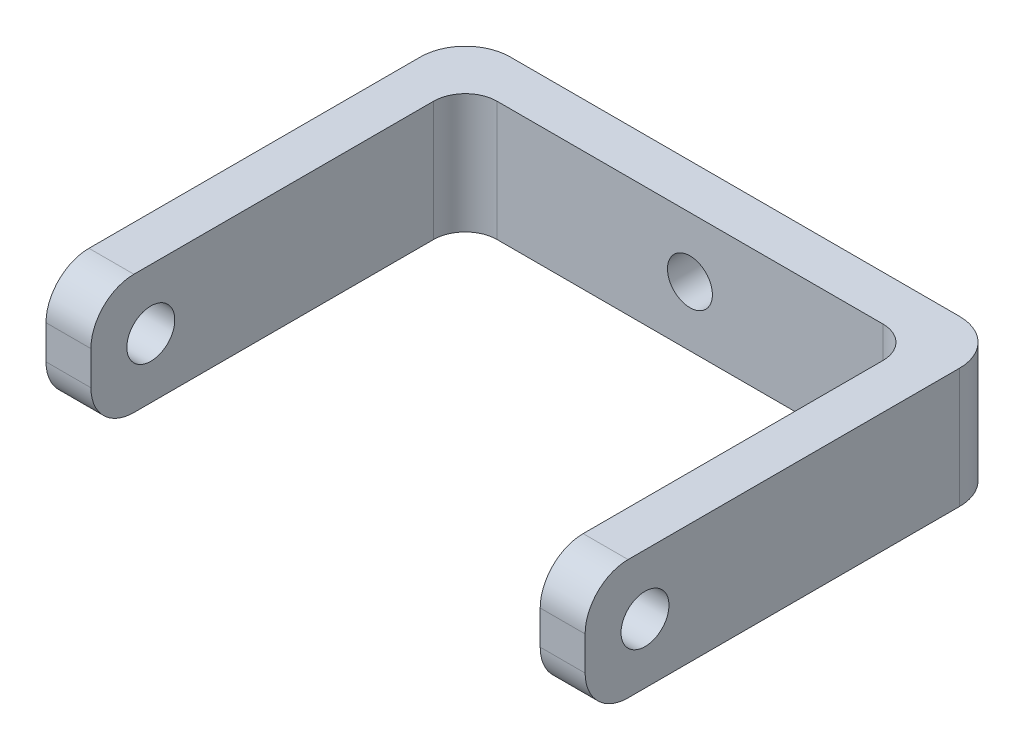
ISO-10303-21;
HEADER;
FILE_DESCRIPTION(('STEP AP214'),'2;1');
FILE_NAME('part.step','',(''),(''),'','','');
FILE_SCHEMA(('AUTOMOTIVE_DESIGN { 1 0 10303 214 1 1 1 1 }'));
ENDSEC;
DATA;
#1=APPLICATION_CONTEXT('core data for automotive mechanical design processes');
#2=APPLICATION_PROTOCOL_DEFINITION('international standard','automotive_design',2000,#1);
#3=PRODUCT_CONTEXT('',#1,'mechanical');
#4=PRODUCT('Part','Part','',(#3));
#5=PRODUCT_RELATED_PRODUCT_CATEGORY('part','',(#4));
#6=PRODUCT_DEFINITION_FORMATION('','',#4);
#7=PRODUCT_DEFINITION_CONTEXT('part definition',#1,'design');
#8=PRODUCT_DEFINITION('design','',#6,#7);
#9=PRODUCT_DEFINITION_SHAPE('','',#8);
#10=(LENGTH_UNIT() NAMED_UNIT(*) SI_UNIT(.MILLI.,.METRE.));
#11=(NAMED_UNIT(*) PLANE_ANGLE_UNIT() SI_UNIT($,.RADIAN.));
#12=(NAMED_UNIT(*) SI_UNIT($,.STERADIAN.) SOLID_ANGLE_UNIT());
#13=UNCERTAINTY_MEASURE_WITH_UNIT(LENGTH_MEASURE(1.E-05),#10,'distance_accuracy_value','');
#14=(GEOMETRIC_REPRESENTATION_CONTEXT(3) GLOBAL_UNCERTAINTY_ASSIGNED_CONTEXT((#13)) GLOBAL_UNIT_ASSIGNED_CONTEXT((#10,
#11,#12)) REPRESENTATION_CONTEXT('',''));
#15=CARTESIAN_POINT('',(0.,0.,0.));
#16=DIRECTION('',(0.,0.,1.));
#17=DIRECTION('',(1.,0.,0.));
#18=AXIS2_PLACEMENT_3D('',#15,#16,#17);
#19=CARTESIAN_POINT('',(30.,8.,0.));
#20=DIRECTION('',(-1.,0.,0.));
#21=DIRECTION('',(0.,0.,1.));
#22=AXIS2_PLACEMENT_3D('',#19,#20,#21);
#23=PLANE('',#22);
#24=CARTESIAN_POINT('',(30.,4.,-4.00000000000004));
#25=DIRECTION('',(-1.,0.,0.));
#26=DIRECTION('',(0.,0.,1.));
#27=AXIS2_PLACEMENT_3D('',#24,#25,#26);
#28=CIRCLE('',#27,1.6);
#29=CARTESIAN_POINT('',(30.,4.,-2.40000000000004));
#30=VERTEX_POINT('',#29);
#31=EDGE_CURVE('E180',#30,#30,#28,.T.);
#32=ORIENTED_EDGE('',*,*,#31,.F.);
#33=EDGE_LOOP('',(#32));
#34=FACE_BOUND('',#33,.T.);
#35=DIRECTION('',(0.,0.,-1.));
#36=VECTOR('',#35,1.);
#37=CARTESIAN_POINT('',(30.,0.,0.));
#38=LINE('',#37,#36);
#39=CARTESIAN_POINT('',(30.,0.,-2.86862915010155));
#40=VERTEX_POINT('',#39);
#41=CARTESIAN_POINT('',(30.,0.,-22.8786796564404));
#42=VERTEX_POINT('',#41);
#43=EDGE_CURVE('E186',#40,#42,#38,.T.);
#44=ORIENTED_EDGE('',*,*,#43,.F.);
#45=CARTESIAN_POINT('',(30.,2.86862915010154,-2.86862915010155));
#46=DIRECTION('',(-1.,0.,0.));
#47=DIRECTION('',(0.,0.,1.));
#48=AXIS2_PLACEMENT_3D('',#45,#46,#47);
#49=CIRCLE('',#48,2.86862915010155);
#50=CARTESIAN_POINT('',(30.,2.86862915010154,0.));
#51=VERTEX_POINT('',#50);
#52=EDGE_CURVE('E245',#40,#51,#49,.T.);
#53=ORIENTED_EDGE('',*,*,#52,.T.);
#54=DIRECTION('',(0.,-1.,0.));
#55=VECTOR('',#54,1.);
#56=CARTESIAN_POINT('',(30.,8.,0.));
#57=LINE('',#56,#55);
#58=CARTESIAN_POINT('',(30.,5.13137084989846,0.));
#59=VERTEX_POINT('',#58);
#60=EDGE_CURVE('E213',#59,#51,#57,.T.);
#61=ORIENTED_EDGE('',*,*,#60,.F.);
#62=CARTESIAN_POINT('',(30.,5.13137084989846,-2.86862915010155));
#63=DIRECTION('',(-1.,0.,0.));
#64=DIRECTION('',(0.,0.,1.));
#65=AXIS2_PLACEMENT_3D('',#62,#63,#64);
#66=CIRCLE('',#65,2.86862915010155);
#67=CARTESIAN_POINT('',(30.,8.,-2.86862915010155));
#68=VERTEX_POINT('',#67);
#69=EDGE_CURVE('E230',#59,#68,#66,.T.);
#70=ORIENTED_EDGE('',*,*,#69,.T.);
#71=DIRECTION('',(0.,0.,-1.));
#72=VECTOR('',#71,1.);
#73=CARTESIAN_POINT('',(30.,8.,0.));
#74=LINE('',#73,#72);
#75=CARTESIAN_POINT('',(30.,8.,-22.8786796564404));
#76=VERTEX_POINT('',#75);
#77=EDGE_CURVE('E274',#68,#76,#74,.T.);
#78=ORIENTED_EDGE('',*,*,#77,.T.);
#79=DIRECTION('',(0.,-1.,0.));
#80=VECTOR('',#79,1.);
#81=CARTESIAN_POINT('',(30.,8.,-22.8786796564404));
#82=LINE('',#81,#80);
#83=EDGE_CURVE('E216',#76,#42,#82,.T.);
#84=ORIENTED_EDGE('',*,*,#83,.T.);
#85=EDGE_LOOP('',(#44,#53,#61,#70,#78,#84));
#86=FACE_BOUND('',#85,.T.);
#87=ADVANCED_FACE('F35',(#34,#86),#23,.T.);
#88=CARTESIAN_POINT('',(0.,8.,0.));
#89=DIRECTION('',(0.,0.,1.));
#90=DIRECTION('',(1.,0.,0.));
#91=AXIS2_PLACEMENT_3D('',#88,#89,#90);
#92=PLANE('',#91);
#93=DIRECTION('',(-1.,0.,0.));
#94=VECTOR('',#93,1.);
#95=CARTESIAN_POINT('',(33.,2.86862915010154,0.));
#96=LINE('',#95,#94);
#97=CARTESIAN_POINT('',(33.,2.86862915010154,0.));
#98=VERTEX_POINT('',#97);
#99=EDGE_CURVE('E253',#98,#51,#96,.T.);
#100=ORIENTED_EDGE('',*,*,#99,.F.);
#101=DIRECTION('',(0.,-1.,0.));
#102=VECTOR('',#101,1.);
#103=CARTESIAN_POINT('',(33.,8.,0.));
#104=LINE('',#103,#102);
#105=CARTESIAN_POINT('',(33.,5.13137084989846,0.));
#106=VERTEX_POINT('',#105);
#107=EDGE_CURVE('E210',#106,#98,#104,.T.);
#108=ORIENTED_EDGE('',*,*,#107,.F.);
#109=DIRECTION('',(-1.,0.,0.));
#110=VECTOR('',#109,1.);
#111=CARTESIAN_POINT('',(33.,5.13137084989846,0.));
#112=LINE('',#111,#110);
#113=EDGE_CURVE('E256',#106,#59,#112,.T.);
#114=ORIENTED_EDGE('',*,*,#113,.T.);
#115=ORIENTED_EDGE('',*,*,#60,.T.);
#116=EDGE_LOOP('',(#100,#108,#114,#115));
#117=FACE_BOUND('',#116,.T.);
#118=ADVANCED_FACE('F303',(#117),#92,.T.);
#119=CARTESIAN_POINT('',(33.,8.,0.));
#120=DIRECTION('',(1.,0.,0.));
#121=DIRECTION('',(0.,0.,-1.));
#122=AXIS2_PLACEMENT_3D('',#119,#120,#121);
#123=PLANE('',#122);
#124=CARTESIAN_POINT('',(33.,4.,-4.00000000000004));
#125=DIRECTION('',(-1.,0.,0.));
#126=DIRECTION('',(0.,0.,1.));
#127=AXIS2_PLACEMENT_3D('',#124,#125,#126);
#128=CIRCLE('',#127,1.6);
#129=CARTESIAN_POINT('',(33.,4.,-2.40000000000004));
#130=VERTEX_POINT('',#129);
#131=EDGE_CURVE('E226',#130,#130,#128,.T.);
#132=ORIENTED_EDGE('',*,*,#131,.T.);
#133=EDGE_LOOP('',(#132));
#134=FACE_BOUND('',#133,.T.);
#135=ORIENTED_EDGE('',*,*,#107,.T.);
#136=CARTESIAN_POINT('',(33.,2.86862915010154,-2.86862915010155));
#137=DIRECTION('',(-1.,0.,0.));
#138=DIRECTION('',(0.,0.,1.));
#139=AXIS2_PLACEMENT_3D('',#136,#137,#138);
#140=CIRCLE('',#139,2.86862915010155);
#141=CARTESIAN_POINT('',(33.,0.,-2.86862915010155));
#142=VERTEX_POINT('',#141);
#143=EDGE_CURVE('E289',#142,#98,#140,.T.);
#144=ORIENTED_EDGE('',*,*,#143,.F.);
#145=DIRECTION('',(0.,0.,1.));
#146=VECTOR('',#145,1.);
#147=CARTESIAN_POINT('',(33.,0.,0.));
#148=LINE('',#147,#146);
#149=CARTESIAN_POINT('',(33.,0.,-25.));
#150=VERTEX_POINT('',#149);
#151=EDGE_CURVE('E188',#150,#142,#148,.T.);
#152=ORIENTED_EDGE('',*,*,#151,.F.);
#153=DIRECTION('',(0.,-1.,0.));
#154=VECTOR('',#153,1.);
#155=CARTESIAN_POINT('',(33.,8.,-25.));
#156=LINE('',#155,#154);
#157=CARTESIAN_POINT('',(33.,8.,-25.));
#158=VERTEX_POINT('',#157);
#159=EDGE_CURVE('E208',#158,#150,#156,.T.);
#160=ORIENTED_EDGE('',*,*,#159,.F.);
#161=DIRECTION('',(0.,0.,1.));
#162=VECTOR('',#161,1.);
#163=CARTESIAN_POINT('',(33.,8.,0.));
#164=LINE('',#163,#162);
#165=CARTESIAN_POINT('',(33.,8.,-2.86862915010155));
#166=VERTEX_POINT('',#165);
#167=EDGE_CURVE('E169',#158,#166,#164,.T.);
#168=ORIENTED_EDGE('',*,*,#167,.T.);
#169=CARTESIAN_POINT('',(33.,5.13137084989846,-2.86862915010155));
#170=DIRECTION('',(-1.,0.,0.));
#171=DIRECTION('',(0.,0.,1.));
#172=AXIS2_PLACEMENT_3D('',#169,#170,#171);
#173=CIRCLE('',#172,2.86862915010155);
#174=EDGE_CURVE('E279',#106,#166,#173,.T.);
#175=ORIENTED_EDGE('',*,*,#174,.F.);
#176=EDGE_LOOP('',(#135,#144,#152,#160,#168,#175));
#177=FACE_BOUND('',#176,.T.);
#178=ADVANCED_FACE('F278',(#134,#177),#123,.T.);
#179=CARTESIAN_POINT('',(-3.,8.,0.));
#180=DIRECTION('',(-1.,0.,0.));
#181=DIRECTION('',(0.,0.,1.));
#182=AXIS2_PLACEMENT_3D('',#179,#180,#181);
#183=PLANE('',#182);
#184=CARTESIAN_POINT('',(-3.,4.,-4.00000000000004));
#185=DIRECTION('',(-1.,0.,0.));
#186=DIRECTION('',(0.,0.,1.));
#187=AXIS2_PLACEMENT_3D('',#184,#185,#186);
#188=CIRCLE('',#187,1.6);
#189=CARTESIAN_POINT('',(-3.,4.,-2.40000000000004));
#190=VERTEX_POINT('',#189);
#191=EDGE_CURVE('E225',#190,#190,#188,.T.);
#192=ORIENTED_EDGE('',*,*,#191,.F.);
#193=EDGE_LOOP('',(#192));
#194=FACE_BOUND('',#193,.T.);
#195=DIRECTION('',(0.,0.,-1.));
#196=VECTOR('',#195,1.);
#197=CARTESIAN_POINT('',(-3.,0.,0.));
#198=LINE('',#197,#196);
#199=CARTESIAN_POINT('',(-3.,0.,-2.86862915010155));
#200=VERTEX_POINT('',#199);
#201=CARTESIAN_POINT('',(-3.,0.,-25.));
#202=VERTEX_POINT('',#201);
#203=EDGE_CURVE('E197',#200,#202,#198,.T.);
#204=ORIENTED_EDGE('',*,*,#203,.F.);
#205=CARTESIAN_POINT('',(-3.,2.86862915010154,-2.86862915010155));
#206=DIRECTION('',(-1.,0.,0.));
#207=DIRECTION('',(0.,0.,1.));
#208=AXIS2_PLACEMENT_3D('',#205,#206,#207);
#209=CIRCLE('',#208,2.86862915010155);
#210=CARTESIAN_POINT('',(-3.,2.86862915010154,0.));
#211=VERTEX_POINT('',#210);
#212=EDGE_CURVE('E39',#200,#211,#209,.T.);
#213=ORIENTED_EDGE('',*,*,#212,.T.);
#214=DIRECTION('',(0.,1.,0.));
#215=VECTOR('',#214,1.);
#216=CARTESIAN_POINT('',(-3.,8.,0.));
#217=LINE('',#216,#215);
#218=CARTESIAN_POINT('',(-3.,5.13137084989846,0.));
#219=VERTEX_POINT('',#218);
#220=EDGE_CURVE('E205',#219,#211,#217,.F.);
#221=ORIENTED_EDGE('',*,*,#220,.F.);
#222=CARTESIAN_POINT('',(-3.,5.13137084989846,-2.86862915010155));
#223=DIRECTION('',(-1.,0.,0.));
#224=DIRECTION('',(0.,0.,1.));
#225=AXIS2_PLACEMENT_3D('',#222,#223,#224);
#226=CIRCLE('',#225,2.86862915010155);
#227=CARTESIAN_POINT('',(-3.,8.,-2.86862915010155));
#228=VERTEX_POINT('',#227);
#229=EDGE_CURVE('E228',#219,#228,#226,.T.);
#230=ORIENTED_EDGE('',*,*,#229,.T.);
#231=DIRECTION('',(0.,0.,-1.));
#232=VECTOR('',#231,1.);
#233=CARTESIAN_POINT('',(-3.,8.,0.));
#234=LINE('',#233,#232);
#235=CARTESIAN_POINT('',(-3.,8.,-25.));
#236=VERTEX_POINT('',#235);
#237=EDGE_CURVE('E160',#228,#236,#234,.T.);
#238=ORIENTED_EDGE('',*,*,#237,.T.);
#239=DIRECTION('',(0.,-1.,0.));
#240=VECTOR('',#239,1.);
#241=CARTESIAN_POINT('',(-3.,8.,-25.));
#242=LINE('',#241,#240);
#243=EDGE_CURVE('E152',#236,#202,#242,.T.);
#244=ORIENTED_EDGE('',*,*,#243,.T.);
#245=EDGE_LOOP('',(#204,#213,#221,#230,#238,#244));
#246=FACE_BOUND('',#245,.T.);
#247=ADVANCED_FACE('F244',(#194,#246),#183,.T.);
#248=CARTESIAN_POINT('',(0.,8.,0.));
#249=DIRECTION('',(0.,0.,1.));
#250=DIRECTION('',(1.,0.,0.));
#251=AXIS2_PLACEMENT_3D('',#248,#249,#250);
#252=PLANE('',#251);
#253=CARTESIAN_POINT('',(0.,2.86862915010154,0.));
#254=VERTEX_POINT('',#253);
#255=EDGE_CURVE('E239',#254,#211,#96,.T.);
#256=ORIENTED_EDGE('',*,*,#255,.F.);
#257=DIRECTION('',(0.,-1.,0.));
#258=VECTOR('',#257,1.);
#259=CARTESIAN_POINT('',(0.,8.,0.));
#260=LINE('',#259,#258);
#261=CARTESIAN_POINT('',(0.,5.13137084989846,0.));
#262=VERTEX_POINT('',#261);
#263=EDGE_CURVE('E202',#262,#254,#260,.T.);
#264=ORIENTED_EDGE('',*,*,#263,.F.);
#265=EDGE_CURVE('E240',#262,#219,#112,.T.);
#266=ORIENTED_EDGE('',*,*,#265,.T.);
#267=ORIENTED_EDGE('',*,*,#220,.T.);
#268=EDGE_LOOP('',(#256,#264,#266,#267));
#269=FACE_BOUND('',#268,.T.);
#270=ADVANCED_FACE('F236',(#269),#252,.T.);
#271=CARTESIAN_POINT('',(0.,8.,0.));
#272=DIRECTION('',(-1.,0.,0.));
#273=DIRECTION('',(0.,0.,1.));
#274=AXIS2_PLACEMENT_3D('',#271,#272,#273);
#275=PLANE('',#274);
#276=CARTESIAN_POINT('',(0.,4.,-4.00000000000004));
#277=DIRECTION('',(-1.,0.,0.));
#278=DIRECTION('',(0.,0.,1.));
#279=AXIS2_PLACEMENT_3D('',#276,#277,#278);
#280=CIRCLE('',#279,1.6);
#281=CARTESIAN_POINT('',(0.,4.,-2.40000000000004));
#282=VERTEX_POINT('',#281);
#283=EDGE_CURVE('E222',#282,#282,#280,.T.);
#284=ORIENTED_EDGE('',*,*,#283,.T.);
#285=EDGE_LOOP('',(#284));
#286=FACE_BOUND('',#285,.T.);
#287=CARTESIAN_POINT('',(0.,2.86862915010154,-2.86862915010155));
#288=DIRECTION('',(-1.,0.,0.));
#289=DIRECTION('',(0.,0.,1.));
#290=AXIS2_PLACEMENT_3D('',#287,#288,#289);
#291=CIRCLE('',#290,2.86862915010155);
#292=CARTESIAN_POINT('',(0.,0.,-2.86862915010155));
#293=VERTEX_POINT('',#292);
#294=EDGE_CURVE('E246',#293,#254,#291,.T.);
#295=ORIENTED_EDGE('',*,*,#294,.F.);
#296=DIRECTION('',(0.,0.,-1.));
#297=VECTOR('',#296,1.);
#298=CARTESIAN_POINT('',(0.,0.,0.));
#299=LINE('',#298,#297);
#300=CARTESIAN_POINT('',(0.,0.,-22.8786796564404));
#301=VERTEX_POINT('',#300);
#302=EDGE_CURVE('E114',#293,#301,#299,.T.);
#303=ORIENTED_EDGE('',*,*,#302,.T.);
#304=DIRECTION('',(0.,-1.,0.));
#305=VECTOR('',#304,1.);
#306=CARTESIAN_POINT('',(0.,8.,-22.8786796564404));
#307=LINE('',#306,#305);
#308=CARTESIAN_POINT('',(0.,8.,-22.8786796564404));
#309=VERTEX_POINT('',#308);
#310=EDGE_CURVE('E175',#309,#301,#307,.T.);
#311=ORIENTED_EDGE('',*,*,#310,.F.);
#312=DIRECTION('',(0.,0.,-1.));
#313=VECTOR('',#312,1.);
#314=CARTESIAN_POINT('',(0.,8.,0.));
#315=LINE('',#314,#313);
#316=CARTESIAN_POINT('',(0.,8.,-2.86862915010155));
#317=VERTEX_POINT('',#316);
#318=EDGE_CURVE('E79',#317,#309,#315,.T.);
#319=ORIENTED_EDGE('',*,*,#318,.F.);
#320=CARTESIAN_POINT('',(0.,5.13137084989846,-2.86862915010155));
#321=DIRECTION('',(-1.,0.,0.));
#322=DIRECTION('',(0.,0.,1.));
#323=AXIS2_PLACEMENT_3D('',#320,#321,#322);
#324=CIRCLE('',#323,2.86862915010155);
#325=EDGE_CURVE('E53',#262,#317,#324,.T.);
#326=ORIENTED_EDGE('',*,*,#325,.F.);
#327=ORIENTED_EDGE('',*,*,#263,.T.);
#328=EDGE_LOOP('',(#295,#303,#311,#319,#326,#327));
#329=FACE_BOUND('',#328,.T.);
#330=ADVANCED_FACE('F323',(#286,#329),#275,.F.);
#331=CARTESIAN_POINT('',(2.12132034355964,8.,-22.8786796564404));
#332=DIRECTION('',(0.,-1.,0.));
#333=DIRECTION('',(0.,0.,-1.));
#334=AXIS2_PLACEMENT_3D('',#331,#332,#333);
#335=CYLINDRICAL_SURFACE('',#334,2.12132034355964);
#336=CARTESIAN_POINT('',(2.12132034355964,0.,-22.8786796564404));
#337=DIRECTION('',(0.,1.,0.));
#338=DIRECTION('',(0.,0.,1.));
#339=AXIS2_PLACEMENT_3D('',#336,#337,#338);
#340=CIRCLE('',#339,2.12132034355964);
#341=CARTESIAN_POINT('',(2.12132034355964,0.,-25.));
#342=VERTEX_POINT('',#341);
#343=EDGE_CURVE('E176',#342,#301,#340,.T.);
#344=ORIENTED_EDGE('',*,*,#343,.F.);
#345=DIRECTION('',(0.,-1.,0.));
#346=VECTOR('',#345,1.);
#347=CARTESIAN_POINT('',(2.12132034355964,8.,-25.));
#348=LINE('',#347,#346);
#349=CARTESIAN_POINT('',(2.12132034355964,8.,-25.));
#350=VERTEX_POINT('',#349);
#351=EDGE_CURVE('E122',#350,#342,#348,.T.);
#352=ORIENTED_EDGE('',*,*,#351,.F.);
#353=CARTESIAN_POINT('',(2.12132034355964,8.,-22.8786796564404));
#354=DIRECTION('',(0.,1.,0.));
#355=DIRECTION('',(0.,0.,1.));
#356=AXIS2_PLACEMENT_3D('',#353,#354,#355);
#357=CIRCLE('',#356,2.12132034355964);
#358=EDGE_CURVE('E200',#350,#309,#357,.T.);
#359=ORIENTED_EDGE('',*,*,#358,.T.);
#360=ORIENTED_EDGE('',*,*,#310,.T.);
#361=EDGE_LOOP('',(#344,#352,#359,#360));
#362=FACE_BOUND('',#361,.T.);
#363=ADVANCED_FACE('F37',(#362),#335,.F.);
#364=CARTESIAN_POINT('',(0.,8.,-25.));
#365=DIRECTION('',(0.,0.,-1.));
#366=DIRECTION('',(-1.,0.,0.));
#367=AXIS2_PLACEMENT_3D('',#364,#365,#366);
#368=PLANE('',#367);
#369=CARTESIAN_POINT('',(15.,4.,-25.));
#370=DIRECTION('',(0.,0.,-1.));
#371=DIRECTION('',(-1.,0.,0.));
#372=AXIS2_PLACEMENT_3D('',#369,#370,#371);
#373=CIRCLE('',#372,1.5);
#374=CARTESIAN_POINT('',(13.5,4.,-25.));
#375=VERTEX_POINT('',#374);
#376=EDGE_CURVE('E359',#375,#375,#373,.T.);
#377=ORIENTED_EDGE('',*,*,#376,.T.);
#378=EDGE_LOOP('',(#377));
#379=FACE_BOUND('',#378,.T.);
#380=DIRECTION('',(1.,0.,0.));
#381=VECTOR('',#380,1.);
#382=CARTESIAN_POINT('',(0.,0.,-25.));
#383=LINE('',#382,#381);
#384=CARTESIAN_POINT('',(27.8786796564404,0.,-25.));
#385=VERTEX_POINT('',#384);
#386=EDGE_CURVE('E179',#342,#385,#383,.T.);
#387=ORIENTED_EDGE('',*,*,#386,.T.);
#388=DIRECTION('',(0.,-1.,0.));
#389=VECTOR('',#388,1.);
#390=CARTESIAN_POINT('',(27.8786796564404,8.,-25.));
#391=LINE('',#390,#389);
#392=CARTESIAN_POINT('',(27.8786796564404,8.,-25.));
#393=VERTEX_POINT('',#392);
#394=EDGE_CURVE('E219',#393,#385,#391,.T.);
#395=ORIENTED_EDGE('',*,*,#394,.F.);
#396=DIRECTION('',(1.,0.,0.));
#397=VECTOR('',#396,1.);
#398=CARTESIAN_POINT('',(0.,8.,-25.));
#399=LINE('',#398,#397);
#400=EDGE_CURVE('E269',#350,#393,#399,.T.);
#401=ORIENTED_EDGE('',*,*,#400,.F.);
#402=ORIENTED_EDGE('',*,*,#351,.T.);
#403=EDGE_LOOP('',(#387,#395,#401,#402));
#404=FACE_BOUND('',#403,.T.);
#405=ADVANCED_FACE('F349',(#379,#404),#368,.F.);
#406=CARTESIAN_POINT('',(27.8786796564404,8.,-22.8786796564404));
#407=DIRECTION('',(0.,-1.,0.));
#408=DIRECTION('',(0.,0.,-1.));
#409=AXIS2_PLACEMENT_3D('',#406,#407,#408);
#410=CYLINDRICAL_SURFACE('',#409,2.12132034355964);
#411=CARTESIAN_POINT('',(27.8786796564404,0.,-22.8786796564404));
#412=DIRECTION('',(0.,1.,0.));
#413=DIRECTION('',(0.,0.,1.));
#414=AXIS2_PLACEMENT_3D('',#411,#412,#413);
#415=CIRCLE('',#414,2.12132034355964);
#416=EDGE_CURVE('E183',#42,#385,#415,.T.);
#417=ORIENTED_EDGE('',*,*,#416,.F.);
#418=ORIENTED_EDGE('',*,*,#83,.F.);
#419=CARTESIAN_POINT('',(27.8786796564404,8.,-22.8786796564404));
#420=DIRECTION('',(0.,1.,0.));
#421=DIRECTION('',(0.,0.,1.));
#422=AXIS2_PLACEMENT_3D('',#419,#420,#421);
#423=CIRCLE('',#422,2.12132034355964);
#424=EDGE_CURVE('E271',#76,#393,#423,.T.);
#425=ORIENTED_EDGE('',*,*,#424,.T.);
#426=ORIENTED_EDGE('',*,*,#394,.T.);
#427=EDGE_LOOP('',(#417,#418,#425,#426));
#428=FACE_BOUND('',#427,.T.);
#429=ADVANCED_FACE('F346',(#428),#410,.F.);
#430=CARTESIAN_POINT('',(30.,8.,-25.));
#431=DIRECTION('',(0.,-1.,0.));
#432=DIRECTION('',(0.,0.,-1.));
#433=AXIS2_PLACEMENT_3D('',#430,#431,#432);
#434=CYLINDRICAL_SURFACE('',#433,3.);
#435=CARTESIAN_POINT('',(30.,0.,-25.));
#436=DIRECTION('',(0.,1.,0.));
#437=DIRECTION('',(0.,0.,1.));
#438=AXIS2_PLACEMENT_3D('',#435,#436,#437);
#439=CIRCLE('',#438,3.);
#440=CARTESIAN_POINT('',(30.,0.,-28.));
#441=VERTEX_POINT('',#440);
#442=EDGE_CURVE('E191',#150,#441,#439,.T.);
#443=ORIENTED_EDGE('',*,*,#442,.T.);
#444=DIRECTION('',(0.,-1.,0.));
#445=VECTOR('',#444,1.);
#446=CARTESIAN_POINT('',(30.,8.,-28.));
#447=LINE('',#446,#445);
#448=CARTESIAN_POINT('',(30.,8.,-28.));
#449=VERTEX_POINT('',#448);
#450=EDGE_CURVE('E151',#449,#441,#447,.T.);
#451=ORIENTED_EDGE('',*,*,#450,.F.);
#452=CARTESIAN_POINT('',(30.,8.,-25.));
#453=DIRECTION('',(0.,1.,0.));
#454=DIRECTION('',(0.,0.,1.));
#455=AXIS2_PLACEMENT_3D('',#452,#453,#454);
#456=CIRCLE('',#455,3.);
#457=EDGE_CURVE('E166',#158,#449,#456,.T.);
#458=ORIENTED_EDGE('',*,*,#457,.F.);
#459=ORIENTED_EDGE('',*,*,#159,.T.);
#460=EDGE_LOOP('',(#443,#451,#458,#459));
#461=FACE_BOUND('',#460,.T.);
#462=ADVANCED_FACE('F348',(#461),#434,.T.);
#463=CARTESIAN_POINT('',(0.,8.,-28.));
#464=DIRECTION('',(0.,0.,-1.));
#465=DIRECTION('',(-1.,0.,0.));
#466=AXIS2_PLACEMENT_3D('',#463,#464,#465);
#467=PLANE('',#466);
#468=CARTESIAN_POINT('',(15.,4.,-28.));
#469=DIRECTION('',(0.,0.,-1.));
#470=DIRECTION('',(-1.,0.,0.));
#471=AXIS2_PLACEMENT_3D('',#468,#469,#470);
#472=CIRCLE('',#471,1.5);
#473=CARTESIAN_POINT('',(13.5,4.,-28.));
#474=VERTEX_POINT('',#473);
#475=EDGE_CURVE('E364',#474,#474,#472,.T.);
#476=ORIENTED_EDGE('',*,*,#475,.F.);
#477=EDGE_LOOP('',(#476));
#478=FACE_BOUND('',#477,.T.);
#479=DIRECTION('',(1.,0.,0.));
#480=VECTOR('',#479,1.);
#481=CARTESIAN_POINT('',(0.,0.,-28.));
#482=LINE('',#481,#480);
#483=CARTESIAN_POINT('',(0.,0.,-28.));
#484=VERTEX_POINT('',#483);
#485=EDGE_CURVE('E147',#484,#441,#482,.T.);
#486=ORIENTED_EDGE('',*,*,#485,.F.);
#487=DIRECTION('',(0.,-1.,0.));
#488=VECTOR('',#487,1.);
#489=CARTESIAN_POINT('',(0.,8.,-28.));
#490=LINE('',#489,#488);
#491=CARTESIAN_POINT('',(0.,8.,-28.));
#492=VERTEX_POINT('',#491);
#493=EDGE_CURVE('E141',#492,#484,#490,.T.);
#494=ORIENTED_EDGE('',*,*,#493,.F.);
#495=DIRECTION('',(1.,0.,0.));
#496=VECTOR('',#495,1.);
#497=CARTESIAN_POINT('',(0.,8.,-28.));
#498=LINE('',#497,#496);
#499=EDGE_CURVE('E145',#492,#449,#498,.T.);
#500=ORIENTED_EDGE('',*,*,#499,.T.);
#501=ORIENTED_EDGE('',*,*,#450,.T.);
#502=EDGE_LOOP('',(#486,#494,#500,#501));
#503=FACE_BOUND('',#502,.T.);
#504=ADVANCED_FACE('F143',(#478,#503),#467,.T.);
#505=CARTESIAN_POINT('',(0.,8.,-25.));
#506=DIRECTION('',(0.,-1.,0.));
#507=DIRECTION('',(0.,0.,-1.));
#508=AXIS2_PLACEMENT_3D('',#505,#506,#507);
#509=CYLINDRICAL_SURFACE('',#508,3.);
#510=CARTESIAN_POINT('',(0.,0.,-25.));
#511=DIRECTION('',(0.,1.,0.));
#512=DIRECTION('',(0.,0.,1.));
#513=AXIS2_PLACEMENT_3D('',#510,#511,#512);
#514=CIRCLE('',#513,3.);
#515=EDGE_CURVE('E195',#484,#202,#514,.T.);
#516=ORIENTED_EDGE('',*,*,#515,.T.);
#517=ORIENTED_EDGE('',*,*,#243,.F.);
#518=CARTESIAN_POINT('',(0.,8.,-25.));
#519=DIRECTION('',(0.,1.,0.));
#520=DIRECTION('',(0.,0.,1.));
#521=AXIS2_PLACEMENT_3D('',#518,#519,#520);
#522=CIRCLE('',#521,3.);
#523=EDGE_CURVE('E156',#492,#236,#522,.T.);
#524=ORIENTED_EDGE('',*,*,#523,.F.);
#525=ORIENTED_EDGE('',*,*,#493,.T.);
#526=EDGE_LOOP('',(#516,#517,#524,#525));
#527=FACE_BOUND('',#526,.T.);
#528=ADVANCED_FACE('F157',(#527),#509,.T.);
#529=CARTESIAN_POINT('',(0.,8.,0.));
#530=DIRECTION('',(0.,1.,0.));
#531=DIRECTION('',(0.,0.,1.));
#532=AXIS2_PLACEMENT_3D('',#529,#530,#531);
#533=PLANE('',#532);
#534=DIRECTION('',(-1.,0.,0.));
#535=VECTOR('',#534,1.);
#536=CARTESIAN_POINT('',(33.,8.,-2.86862915010155));
#537=LINE('',#536,#535);
#538=EDGE_CURVE('E284',#166,#68,#537,.T.);
#539=ORIENTED_EDGE('',*,*,#538,.F.);
#540=ORIENTED_EDGE('',*,*,#167,.F.);
#541=ORIENTED_EDGE('',*,*,#457,.T.);
#542=ORIENTED_EDGE('',*,*,#499,.F.);
#543=ORIENTED_EDGE('',*,*,#523,.T.);
#544=ORIENTED_EDGE('',*,*,#237,.F.);
#545=DIRECTION('',(-1.,0.,0.));
#546=VECTOR('',#545,1.);
#547=CARTESIAN_POINT('',(33.,8.00000000000001,-2.86862915010155));
#548=LINE('',#547,#546);
#549=EDGE_CURVE('E11',#317,#228,#548,.T.);
#550=ORIENTED_EDGE('',*,*,#549,.F.);
#551=ORIENTED_EDGE('',*,*,#318,.T.);
#552=ORIENTED_EDGE('',*,*,#358,.F.);
#553=ORIENTED_EDGE('',*,*,#400,.T.);
#554=ORIENTED_EDGE('',*,*,#424,.F.);
#555=ORIENTED_EDGE('',*,*,#77,.F.);
#556=EDGE_LOOP('',(#539,#540,#541,#542,#543,#544,#550,#551,#552,#553,#554,#555));
#557=FACE_BOUND('',#556,.T.);
#558=ADVANCED_FACE('F163',(#557),#533,.T.);
#559=CARTESIAN_POINT('',(0.,0.,0.));
#560=DIRECTION('',(0.,1.,0.));
#561=DIRECTION('',(0.,0.,1.));
#562=AXIS2_PLACEMENT_3D('',#559,#560,#561);
#563=PLANE('',#562);
#564=ORIENTED_EDGE('',*,*,#151,.T.);
#565=DIRECTION('',(-1.,0.,0.));
#566=VECTOR('',#565,1.);
#567=CARTESIAN_POINT('',(33.,0.,-2.86862915010155));
#568=LINE('',#567,#566);
#569=EDGE_CURVE('E250',#142,#40,#568,.T.);
#570=ORIENTED_EDGE('',*,*,#569,.T.);
#571=ORIENTED_EDGE('',*,*,#43,.T.);
#572=ORIENTED_EDGE('',*,*,#416,.T.);
#573=ORIENTED_EDGE('',*,*,#386,.F.);
#574=ORIENTED_EDGE('',*,*,#343,.T.);
#575=ORIENTED_EDGE('',*,*,#302,.F.);
#576=DIRECTION('',(-1.,0.,0.));
#577=VECTOR('',#576,1.);
#578=CARTESIAN_POINT('',(33.,0.,-2.86862915010155));
#579=LINE('',#578,#577);
#580=EDGE_CURVE('E45',#293,#200,#579,.T.);
#581=ORIENTED_EDGE('',*,*,#580,.T.);
#582=ORIENTED_EDGE('',*,*,#203,.T.);
#583=ORIENTED_EDGE('',*,*,#515,.F.);
#584=ORIENTED_EDGE('',*,*,#485,.T.);
#585=ORIENTED_EDGE('',*,*,#442,.F.);
#586=EDGE_LOOP('',(#564,#570,#571,#572,#573,#574,#575,#581,#582,#583,#584,#585));
#587=FACE_BOUND('',#586,.T.);
#588=ADVANCED_FACE('F312',(#587),#563,.F.);
#589=CARTESIAN_POINT('',(33.,4.,-4.00000000000004));
#590=DIRECTION('',(-1.,0.,0.));
#591=DIRECTION('',(0.,0.,1.));
#592=AXIS2_PLACEMENT_3D('',#589,#590,#591);
#593=CYLINDRICAL_SURFACE('',#592,1.6);
#594=ORIENTED_EDGE('',*,*,#191,.T.);
#595=EDGE_LOOP('',(#594));
#596=FACE_BOUND('',#595,.T.);
#597=ORIENTED_EDGE('',*,*,#283,.F.);
#598=EDGE_LOOP('',(#597));
#599=FACE_BOUND('',#598,.T.);
#600=ADVANCED_FACE('F391',(#596,#599),#593,.F.);
#601=ORIENTED_EDGE('',*,*,#31,.T.);
#602=EDGE_LOOP('',(#601));
#603=FACE_BOUND('',#602,.T.);
#604=ORIENTED_EDGE('',*,*,#131,.F.);
#605=EDGE_LOOP('',(#604));
#606=FACE_BOUND('',#605,.T.);
#607=ADVANCED_FACE('F389',(#603,#606),#593,.F.);
#608=CARTESIAN_POINT('',(33.,2.86862915010154,-2.86862915010155));
#609=DIRECTION('',(-1.,0.,0.));
#610=DIRECTION('',(0.,0.,1.));
#611=AXIS2_PLACEMENT_3D('',#608,#609,#610);
#612=CYLINDRICAL_SURFACE('',#611,2.86862915010155);
#613=ORIENTED_EDGE('',*,*,#580,.F.);
#614=ORIENTED_EDGE('',*,*,#294,.T.);
#615=ORIENTED_EDGE('',*,*,#255,.T.);
#616=ORIENTED_EDGE('',*,*,#212,.F.);
#617=EDGE_LOOP('',(#613,#614,#615,#616));
#618=FACE_BOUND('',#617,.T.);
#619=ADVANCED_FACE('F322',(#618),#612,.T.);
#620=ORIENTED_EDGE('',*,*,#569,.F.);
#621=ORIENTED_EDGE('',*,*,#143,.T.);
#622=ORIENTED_EDGE('',*,*,#99,.T.);
#623=ORIENTED_EDGE('',*,*,#52,.F.);
#624=EDGE_LOOP('',(#620,#621,#622,#623));
#625=FACE_BOUND('',#624,.T.);
#626=ADVANCED_FACE('F309',(#625),#612,.T.);
#627=CARTESIAN_POINT('',(33.,5.13137084989846,-2.86862915010155));
#628=DIRECTION('',(-1.,0.,0.));
#629=DIRECTION('',(0.,0.,1.));
#630=AXIS2_PLACEMENT_3D('',#627,#628,#629);
#631=CYLINDRICAL_SURFACE('',#630,2.86862915010155);
#632=ORIENTED_EDGE('',*,*,#265,.F.);
#633=ORIENTED_EDGE('',*,*,#325,.T.);
#634=ORIENTED_EDGE('',*,*,#549,.T.);
#635=ORIENTED_EDGE('',*,*,#229,.F.);
#636=EDGE_LOOP('',(#632,#633,#634,#635));
#637=FACE_BOUND('',#636,.T.);
#638=ADVANCED_FACE('F325',(#637),#631,.T.);
#639=ORIENTED_EDGE('',*,*,#113,.F.);
#640=ORIENTED_EDGE('',*,*,#174,.T.);
#641=ORIENTED_EDGE('',*,*,#538,.T.);
#642=ORIENTED_EDGE('',*,*,#69,.F.);
#643=EDGE_LOOP('',(#639,#640,#641,#642));
#644=FACE_BOUND('',#643,.T.);
#645=ADVANCED_FACE('F327',(#644),#631,.T.);
#646=CARTESIAN_POINT('',(15.,4.,-23.));
#647=DIRECTION('',(0.,0.,-1.));
#648=DIRECTION('',(-1.,0.,0.));
#649=AXIS2_PLACEMENT_3D('',#646,#647,#648);
#650=CYLINDRICAL_SURFACE('',#649,1.5);
#651=ORIENTED_EDGE('',*,*,#475,.T.);
#652=EDGE_LOOP('',(#651));
#653=FACE_BOUND('',#652,.T.);
#654=ORIENTED_EDGE('',*,*,#376,.F.);
#655=EDGE_LOOP('',(#654));
#656=FACE_BOUND('',#655,.T.);
#657=ADVANCED_FACE('F333',(#653,#656),#650,.F.);
#658=CLOSED_SHELL('',(#87,#118,#178,#247,#270,#330,#363,#405,#429,#462,#504,#528,#558,#588,#600,
#607,#619,#626,#638,#645,#657));
#659=MANIFOLD_SOLID_BREP('B2',#658);
#660=ADVANCED_BREP_SHAPE_REPRESENTATION('',(#18,#659),#14);
#661=SHAPE_DEFINITION_REPRESENTATION(#9,#660);
ENDSEC;
END-ISO-10303-21;
